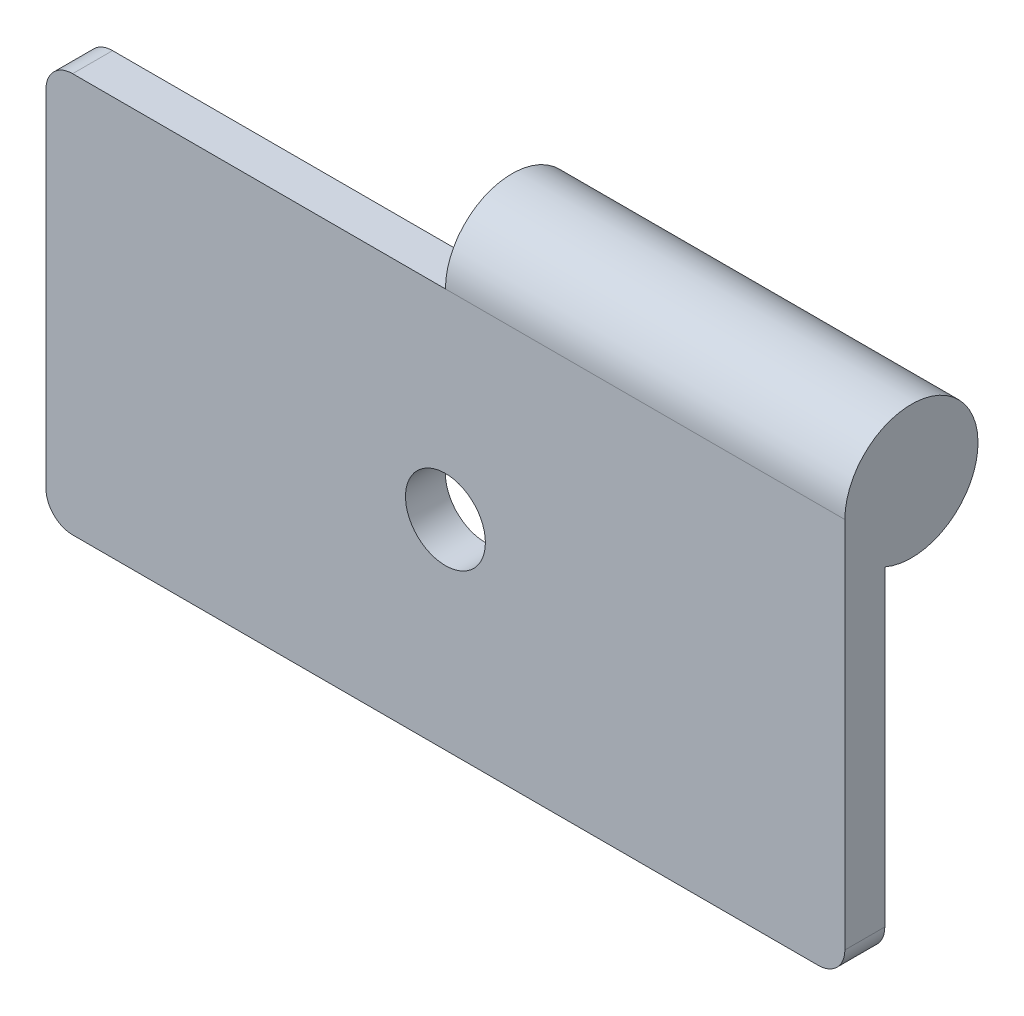
ISO-10303-21;
HEADER;
FILE_DESCRIPTION(('STEP AP214'),'2;1');
FILE_NAME('part.step','',(''),(''),'','','');
FILE_SCHEMA(('AUTOMOTIVE_DESIGN { 1 0 10303 214 1 1 1 1 }'));
ENDSEC;
DATA;
#1=APPLICATION_CONTEXT('core data for automotive mechanical design processes');
#2=APPLICATION_PROTOCOL_DEFINITION('international standard','automotive_design',2000,#1);
#3=PRODUCT_CONTEXT('',#1,'mechanical');
#4=PRODUCT('Part','Part','',(#3));
#5=PRODUCT_RELATED_PRODUCT_CATEGORY('part','',(#4));
#6=PRODUCT_DEFINITION_FORMATION('','',#4);
#7=PRODUCT_DEFINITION_CONTEXT('part definition',#1,'design');
#8=PRODUCT_DEFINITION('design','',#6,#7);
#9=PRODUCT_DEFINITION_SHAPE('','',#8);
#10=(LENGTH_UNIT() NAMED_UNIT(*) SI_UNIT(.MILLI.,.METRE.));
#11=(NAMED_UNIT(*) PLANE_ANGLE_UNIT() SI_UNIT($,.RADIAN.));
#12=(NAMED_UNIT(*) SI_UNIT($,.STERADIAN.) SOLID_ANGLE_UNIT());
#13=UNCERTAINTY_MEASURE_WITH_UNIT(LENGTH_MEASURE(1.E-05),#10,'distance_accuracy_value','');
#14=(GEOMETRIC_REPRESENTATION_CONTEXT(3) GLOBAL_UNCERTAINTY_ASSIGNED_CONTEXT((#13)) GLOBAL_UNIT_ASSIGNED_CONTEXT((#10,
#11,#12)) REPRESENTATION_CONTEXT('',''));
#15=CARTESIAN_POINT('',(0.,0.,0.));
#16=DIRECTION('',(0.,0.,1.));
#17=DIRECTION('',(1.,0.,0.));
#18=AXIS2_PLACEMENT_3D('',#15,#16,#17);
#19=CARTESIAN_POINT('',(-15.,7.5,-1.5));
#20=DIRECTION('',(0.,1.,0.));
#21=DIRECTION('',(0.,0.,1.));
#22=AXIS2_PLACEMENT_3D('',#19,#20,#21);
#23=PLANE('',#22);
#24=DIRECTION('',(-1.,0.,0.));
#25=VECTOR('',#24,1.);
#26=CARTESIAN_POINT('',(-15.,7.5,-1.5));
#27=LINE('',#26,#25);
#28=CARTESIAN_POINT('',(0.,7.5,-1.5));
#29=VERTEX_POINT('',#28);
#30=CARTESIAN_POINT('',(-14.,7.5,-1.5));
#31=VERTEX_POINT('',#30);
#32=EDGE_CURVE('E150',#29,#31,#27,.T.);
#33=ORIENTED_EDGE('',*,*,#32,.T.);
#34=DIRECTION('',(0.,0.,1.));
#35=VECTOR('',#34,1.);
#36=CARTESIAN_POINT('',(-14.,7.5,-1.5));
#37=LINE('',#36,#35);
#38=CARTESIAN_POINT('',(-14.,7.5,0.));
#39=VERTEX_POINT('',#38);
#40=EDGE_CURVE('E11',#31,#39,#37,.T.);
#41=ORIENTED_EDGE('',*,*,#40,.T.);
#42=DIRECTION('',(-1.,0.,0.));
#43=VECTOR('',#42,1.);
#44=CARTESIAN_POINT('',(-15.,7.5,0.));
#45=LINE('',#44,#43);
#46=CARTESIAN_POINT('',(0.,7.5,0.));
#47=VERTEX_POINT('',#46);
#48=EDGE_CURVE('E119',#47,#39,#45,.T.);
#49=ORIENTED_EDGE('',*,*,#48,.F.);
#50=DIRECTION('',(0.,0.,-1.));
#51=VECTOR('',#50,1.);
#52=CARTESIAN_POINT('',(0.,7.5,-1.5));
#53=LINE('',#52,#51);
#54=EDGE_CURVE('E145',#47,#29,#53,.T.);
#55=ORIENTED_EDGE('',*,*,#54,.T.);
#56=EDGE_LOOP('',(#33,#41,#49,#55));
#57=FACE_BOUND('',#56,.T.);
#58=ADVANCED_FACE('F39',(#57),#23,.T.);
#59=CARTESIAN_POINT('',(15.,-7.5,-1.5));
#60=DIRECTION('',(1.,0.,0.));
#61=DIRECTION('',(0.,0.,-1.));
#62=AXIS2_PLACEMENT_3D('',#59,#60,#61);
#63=PLANE('',#62);
#64=DIRECTION('',(0.,1.,0.));
#65=VECTOR('',#64,1.);
#66=CARTESIAN_POINT('',(15.,-7.5,0.));
#67=LINE('',#66,#65);
#68=CARTESIAN_POINT('',(15.,-6.5,0.));
#69=VERTEX_POINT('',#68);
#70=CARTESIAN_POINT('',(15.,7.5,0.));
#71=VERTEX_POINT('',#70);
#72=EDGE_CURVE('E109',#69,#71,#67,.T.);
#73=ORIENTED_EDGE('',*,*,#72,.F.);
#74=DIRECTION('',(0.,0.,1.));
#75=VECTOR('',#74,1.);
#76=CARTESIAN_POINT('',(15.,-6.5,-1.5));
#77=LINE('',#76,#75);
#78=CARTESIAN_POINT('',(15.,-6.5,-1.5));
#79=VERTEX_POINT('',#78);
#80=EDGE_CURVE('E171',#69,#79,#77,.F.);
#81=ORIENTED_EDGE('',*,*,#80,.T.);
#82=DIRECTION('',(0.,1.,0.));
#83=VECTOR('',#82,1.);
#84=CARTESIAN_POINT('',(15.,-7.5,-1.5));
#85=LINE('',#84,#83);
#86=CARTESIAN_POINT('',(15.,5.20871215252208,-1.5));
#87=VERTEX_POINT('',#86);
#88=EDGE_CURVE('E134',#79,#87,#85,.T.);
#89=ORIENTED_EDGE('',*,*,#88,.T.);
#90=CARTESIAN_POINT('',(15.,7.5,-2.5));
#91=DIRECTION('',(1.,0.,0.));
#92=DIRECTION('',(0.,0.,-1.));
#93=AXIS2_PLACEMENT_3D('',#90,#91,#92);
#94=CIRCLE('',#93,2.5);
#95=EDGE_CURVE('E125',#87,#71,#94,.T.);
#96=ORIENTED_EDGE('',*,*,#95,.T.);
#97=EDGE_LOOP('',(#73,#81,#89,#96));
#98=FACE_BOUND('',#97,.T.);
#99=ADVANCED_FACE('F132',(#98),#63,.T.);
#100=CARTESIAN_POINT('',(-15.,-7.5,-1.5));
#101=DIRECTION('',(0.,-1.,0.));
#102=DIRECTION('',(0.,0.,-1.));
#103=AXIS2_PLACEMENT_3D('',#100,#101,#102);
#104=PLANE('',#103);
#105=DIRECTION('',(1.,0.,0.));
#106=VECTOR('',#105,1.);
#107=CARTESIAN_POINT('',(-15.,-7.5,-1.5));
#108=LINE('',#107,#106);
#109=CARTESIAN_POINT('',(-14.,-7.5,-1.5));
#110=VERTEX_POINT('',#109);
#111=CARTESIAN_POINT('',(14.,-7.5,-1.5));
#112=VERTEX_POINT('',#111);
#113=EDGE_CURVE('E155',#110,#112,#108,.T.);
#114=ORIENTED_EDGE('',*,*,#113,.T.);
#115=DIRECTION('',(0.,0.,1.));
#116=VECTOR('',#115,1.);
#117=CARTESIAN_POINT('',(14.,-7.5,-1.5));
#118=LINE('',#117,#116);
#119=CARTESIAN_POINT('',(14.,-7.5,0.));
#120=VERTEX_POINT('',#119);
#121=EDGE_CURVE('E163',#112,#120,#118,.T.);
#122=ORIENTED_EDGE('',*,*,#121,.T.);
#123=DIRECTION('',(1.,0.,0.));
#124=VECTOR('',#123,1.);
#125=CARTESIAN_POINT('',(-15.,-7.5,0.));
#126=LINE('',#125,#124);
#127=CARTESIAN_POINT('',(-14.,-7.5,0.));
#128=VERTEX_POINT('',#127);
#129=EDGE_CURVE('E151',#128,#120,#126,.T.);
#130=ORIENTED_EDGE('',*,*,#129,.F.);
#131=DIRECTION('',(0.,0.,1.));
#132=VECTOR('',#131,1.);
#133=CARTESIAN_POINT('',(-14.,-7.5,-1.5));
#134=LINE('',#133,#132);
#135=EDGE_CURVE('E157',#128,#110,#134,.F.);
#136=ORIENTED_EDGE('',*,*,#135,.T.);
#137=EDGE_LOOP('',(#114,#122,#130,#136));
#138=FACE_BOUND('',#137,.T.);
#139=ADVANCED_FACE('F209',(#138),#104,.T.);
#140=CARTESIAN_POINT('',(-15.,-7.5,-1.5));
#141=DIRECTION('',(-1.,0.,0.));
#142=DIRECTION('',(0.,0.,1.));
#143=AXIS2_PLACEMENT_3D('',#140,#141,#142);
#144=PLANE('',#143);
#145=DIRECTION('',(0.,-1.,0.));
#146=VECTOR('',#145,1.);
#147=CARTESIAN_POINT('',(-15.,-7.5,-1.5));
#148=LINE('',#147,#146);
#149=CARTESIAN_POINT('',(-15.,6.5,-1.5));
#150=VERTEX_POINT('',#149);
#151=CARTESIAN_POINT('',(-15.,-6.5,-1.5));
#152=VERTEX_POINT('',#151);
#153=EDGE_CURVE('E153',#150,#152,#148,.T.);
#154=ORIENTED_EDGE('',*,*,#153,.T.);
#155=DIRECTION('',(0.,0.,1.));
#156=VECTOR('',#155,1.);
#157=CARTESIAN_POINT('',(-15.,-6.5,-1.5));
#158=LINE('',#157,#156);
#159=CARTESIAN_POINT('',(-15.,-6.5,0.));
#160=VERTEX_POINT('',#159);
#161=EDGE_CURVE('E47',#152,#160,#158,.T.);
#162=ORIENTED_EDGE('',*,*,#161,.T.);
#163=DIRECTION('',(0.,-1.,0.));
#164=VECTOR('',#163,1.);
#165=CARTESIAN_POINT('',(-15.,-7.5,0.));
#166=LINE('',#165,#164);
#167=CARTESIAN_POINT('',(-15.,6.5,0.));
#168=VERTEX_POINT('',#167);
#169=EDGE_CURVE('E130',#168,#160,#166,.T.);
#170=ORIENTED_EDGE('',*,*,#169,.F.);
#171=DIRECTION('',(0.,0.,1.));
#172=VECTOR('',#171,1.);
#173=CARTESIAN_POINT('',(-15.,6.5,-1.5));
#174=LINE('',#173,#172);
#175=EDGE_CURVE('E177',#168,#150,#174,.F.);
#176=ORIENTED_EDGE('',*,*,#175,.T.);
#177=EDGE_LOOP('',(#154,#162,#170,#176));
#178=FACE_BOUND('',#177,.T.);
#179=ADVANCED_FACE('F182',(#178),#144,.T.);
#180=CARTESIAN_POINT('',(0.,0.,-1.5));
#181=DIRECTION('',(0.,0.,-1.));
#182=DIRECTION('',(-1.,0.,0.));
#183=AXIS2_PLACEMENT_3D('',#180,#181,#182);
#184=PLANE('',#183);
#185=CARTESIAN_POINT('',(0.,0.,-1.5));
#186=DIRECTION('',(0.,0.,-1.));
#187=DIRECTION('',(-1.,0.,0.));
#188=AXIS2_PLACEMENT_3D('',#185,#186,#187);
#189=CIRCLE('',#188,1.5);
#190=CARTESIAN_POINT('',(-1.5,0.,-1.5));
#191=VERTEX_POINT('',#190);
#192=EDGE_CURVE('E135',#191,#191,#189,.T.);
#193=ORIENTED_EDGE('',*,*,#192,.F.);
#194=EDGE_LOOP('',(#193));
#195=FACE_BOUND('',#194,.T.);
#196=ORIENTED_EDGE('',*,*,#88,.F.);
#197=CARTESIAN_POINT('',(14.,-6.5,-1.5));
#198=DIRECTION('',(0.,0.,-1.));
#199=DIRECTION('',(-1.,0.,0.));
#200=AXIS2_PLACEMENT_3D('',#197,#198,#199);
#201=CIRCLE('',#200,1.);
#202=EDGE_CURVE('E175',#79,#112,#201,.T.);
#203=ORIENTED_EDGE('',*,*,#202,.T.);
#204=ORIENTED_EDGE('',*,*,#113,.F.);
#205=CARTESIAN_POINT('',(-14.,-6.5,-1.5));
#206=DIRECTION('',(0.,0.,-1.));
#207=DIRECTION('',(-1.,0.,0.));
#208=AXIS2_PLACEMENT_3D('',#205,#206,#207);
#209=CIRCLE('',#208,1.);
#210=EDGE_CURVE('E60',#110,#152,#209,.T.);
#211=ORIENTED_EDGE('',*,*,#210,.T.);
#212=ORIENTED_EDGE('',*,*,#153,.F.);
#213=CARTESIAN_POINT('',(-14.,6.5,-1.5));
#214=DIRECTION('',(0.,0.,-1.));
#215=DIRECTION('',(-1.,0.,0.));
#216=AXIS2_PLACEMENT_3D('',#213,#214,#215);
#217=CIRCLE('',#216,1.);
#218=EDGE_CURVE('E54',#150,#31,#217,.T.);
#219=ORIENTED_EDGE('',*,*,#218,.T.);
#220=ORIENTED_EDGE('',*,*,#32,.F.);
#221=DIRECTION('',(0.,-1.,0.));
#222=VECTOR('',#221,1.);
#223=CARTESIAN_POINT('',(0.,0.,-1.5));
#224=LINE('',#223,#222);
#225=CARTESIAN_POINT('',(0.,5.20871215252208,-1.5));
#226=VERTEX_POINT('',#225);
#227=EDGE_CURVE('E137',#29,#226,#224,.T.);
#228=ORIENTED_EDGE('',*,*,#227,.T.);
#229=DIRECTION('',(1.,0.,0.));
#230=VECTOR('',#229,1.);
#231=CARTESIAN_POINT('',(0.,5.20871215252208,-1.5));
#232=LINE('',#231,#230);
#233=EDGE_CURVE('E120',#87,#226,#232,.F.);
#234=ORIENTED_EDGE('',*,*,#233,.F.);
#235=EDGE_LOOP('',(#196,#203,#204,#211,#212,#219,#220,#228,#234));
#236=FACE_BOUND('',#235,.T.);
#237=ADVANCED_FACE('F190',(#195,#236),#184,.T.);
#238=CARTESIAN_POINT('',(0.,0.,0.));
#239=DIRECTION('',(0.,0.,-1.));
#240=DIRECTION('',(-1.,0.,0.));
#241=AXIS2_PLACEMENT_3D('',#238,#239,#240);
#242=PLANE('',#241);
#243=CARTESIAN_POINT('',(0.,0.,0.));
#244=DIRECTION('',(0.,0.,1.));
#245=DIRECTION('',(1.,0.,0.));
#246=AXIS2_PLACEMENT_3D('',#243,#244,#245);
#247=CIRCLE('',#246,1.5);
#248=CARTESIAN_POINT('',(1.5,0.,0.));
#249=VERTEX_POINT('',#248);
#250=EDGE_CURVE('E140',#249,#249,#247,.T.);
#251=ORIENTED_EDGE('',*,*,#250,.F.);
#252=EDGE_LOOP('',(#251));
#253=FACE_BOUND('',#252,.T.);
#254=ORIENTED_EDGE('',*,*,#129,.T.);
#255=CARTESIAN_POINT('',(14.,-6.5,0.));
#256=DIRECTION('',(0.,0.,-1.));
#257=DIRECTION('',(-1.,0.,0.));
#258=AXIS2_PLACEMENT_3D('',#255,#256,#257);
#259=CIRCLE('',#258,1.);
#260=EDGE_CURVE('E115',#120,#69,#259,.F.);
#261=ORIENTED_EDGE('',*,*,#260,.T.);
#262=ORIENTED_EDGE('',*,*,#72,.T.);
#263=EDGE_CURVE('E114',#71,#47,#45,.T.);
#264=ORIENTED_EDGE('',*,*,#263,.T.);
#265=ORIENTED_EDGE('',*,*,#48,.T.);
#266=CARTESIAN_POINT('',(-14.,6.5,0.));
#267=DIRECTION('',(0.,0.,-1.));
#268=DIRECTION('',(-1.,0.,0.));
#269=AXIS2_PLACEMENT_3D('',#266,#267,#268);
#270=CIRCLE('',#269,1.);
#271=EDGE_CURVE('E166',#39,#168,#270,.F.);
#272=ORIENTED_EDGE('',*,*,#271,.T.);
#273=ORIENTED_EDGE('',*,*,#169,.T.);
#274=CARTESIAN_POINT('',(-14.,-6.5,0.));
#275=DIRECTION('',(0.,0.,-1.));
#276=DIRECTION('',(-1.,0.,0.));
#277=AXIS2_PLACEMENT_3D('',#274,#275,#276);
#278=CIRCLE('',#277,1.);
#279=EDGE_CURVE('E168',#160,#128,#278,.F.);
#280=ORIENTED_EDGE('',*,*,#279,.T.);
#281=EDGE_LOOP('',(#254,#261,#262,#264,#265,#272,#273,#280));
#282=FACE_BOUND('',#281,.T.);
#283=ADVANCED_FACE('F112',(#253,#282),#242,.F.);
#284=CARTESIAN_POINT('',(0.,7.5,-2.5));
#285=DIRECTION('',(1.,0.,0.));
#286=DIRECTION('',(0.,0.,-1.));
#287=AXIS2_PLACEMENT_3D('',#284,#285,#286);
#288=CYLINDRICAL_SURFACE('',#287,2.5);
#289=ORIENTED_EDGE('',*,*,#95,.F.);
#290=ORIENTED_EDGE('',*,*,#233,.T.);
#291=CARTESIAN_POINT('',(0.,7.5,-2.5));
#292=DIRECTION('',(1.,0.,0.));
#293=DIRECTION('',(0.,0.,-1.));
#294=AXIS2_PLACEMENT_3D('',#291,#292,#293);
#295=CIRCLE('',#294,2.5);
#296=EDGE_CURVE('E128',#226,#47,#295,.T.);
#297=ORIENTED_EDGE('',*,*,#296,.T.);
#298=ORIENTED_EDGE('',*,*,#263,.F.);
#299=EDGE_LOOP('',(#289,#290,#297,#298));
#300=FACE_BOUND('',#299,.T.);
#301=ADVANCED_FACE('F124',(#300),#288,.T.);
#302=CARTESIAN_POINT('',(0.,7.5,-2.5));
#303=DIRECTION('',(1.,0.,0.));
#304=DIRECTION('',(0.,0.,-1.));
#305=AXIS2_PLACEMENT_3D('',#302,#303,#304);
#306=PLANE('',#305);
#307=ORIENTED_EDGE('',*,*,#54,.F.);
#308=ORIENTED_EDGE('',*,*,#296,.F.);
#309=ORIENTED_EDGE('',*,*,#227,.F.);
#310=EDGE_LOOP('',(#307,#308,#309));
#311=FACE_BOUND('',#310,.T.);
#312=ADVANCED_FACE('F192',(#311),#306,.F.);
#313=CARTESIAN_POINT('',(0.,0.,-15.));
#314=DIRECTION('',(0.,0.,1.));
#315=DIRECTION('',(1.,0.,0.));
#316=AXIS2_PLACEMENT_3D('',#313,#314,#315);
#317=CYLINDRICAL_SURFACE('',#316,1.5);
#318=ORIENTED_EDGE('',*,*,#192,.T.);
#319=EDGE_LOOP('',(#318));
#320=FACE_BOUND('',#319,.T.);
#321=ORIENTED_EDGE('',*,*,#250,.T.);
#322=EDGE_LOOP('',(#321));
#323=FACE_BOUND('',#322,.T.);
#324=ADVANCED_FACE('F194',(#320,#323),#317,.F.);
#325=CARTESIAN_POINT('',(14.,-6.5,-1.5));
#326=DIRECTION('',(0.,0.,1.));
#327=DIRECTION('',(1.,0.,0.));
#328=AXIS2_PLACEMENT_3D('',#325,#326,#327);
#329=CYLINDRICAL_SURFACE('',#328,1.);
#330=ORIENTED_EDGE('',*,*,#202,.F.);
#331=ORIENTED_EDGE('',*,*,#80,.F.);
#332=ORIENTED_EDGE('',*,*,#260,.F.);
#333=ORIENTED_EDGE('',*,*,#121,.F.);
#334=EDGE_LOOP('',(#330,#331,#332,#333));
#335=FACE_BOUND('',#334,.T.);
#336=ADVANCED_FACE('F200',(#335),#329,.T.);
#337=CARTESIAN_POINT('',(-14.,-6.5,-1.5));
#338=DIRECTION('',(0.,0.,1.));
#339=DIRECTION('',(1.,0.,0.));
#340=AXIS2_PLACEMENT_3D('',#337,#338,#339);
#341=CYLINDRICAL_SURFACE('',#340,1.);
#342=ORIENTED_EDGE('',*,*,#210,.F.);
#343=ORIENTED_EDGE('',*,*,#135,.F.);
#344=ORIENTED_EDGE('',*,*,#279,.F.);
#345=ORIENTED_EDGE('',*,*,#161,.F.);
#346=EDGE_LOOP('',(#342,#343,#344,#345));
#347=FACE_BOUND('',#346,.T.);
#348=ADVANCED_FACE('F215',(#347),#341,.T.);
#349=CARTESIAN_POINT('',(-14.,6.5,-1.5));
#350=DIRECTION('',(0.,0.,1.));
#351=DIRECTION('',(1.,0.,0.));
#352=AXIS2_PLACEMENT_3D('',#349,#350,#351);
#353=CYLINDRICAL_SURFACE('',#352,1.);
#354=ORIENTED_EDGE('',*,*,#218,.F.);
#355=ORIENTED_EDGE('',*,*,#175,.F.);
#356=ORIENTED_EDGE('',*,*,#271,.F.);
#357=ORIENTED_EDGE('',*,*,#40,.F.);
#358=EDGE_LOOP('',(#354,#355,#356,#357));
#359=FACE_BOUND('',#358,.T.);
#360=ADVANCED_FACE('F41',(#359),#353,.T.);
#361=CLOSED_SHELL('',(#58,#99,#139,#179,#237,#283,#301,#312,#324,#336,#348,#360));
#362=MANIFOLD_SOLID_BREP('B2',#361);
#363=ADVANCED_BREP_SHAPE_REPRESENTATION('',(#18,#362),#14);
#364=SHAPE_DEFINITION_REPRESENTATION(#9,#363);
ENDSEC;
END-ISO-10303-21;
